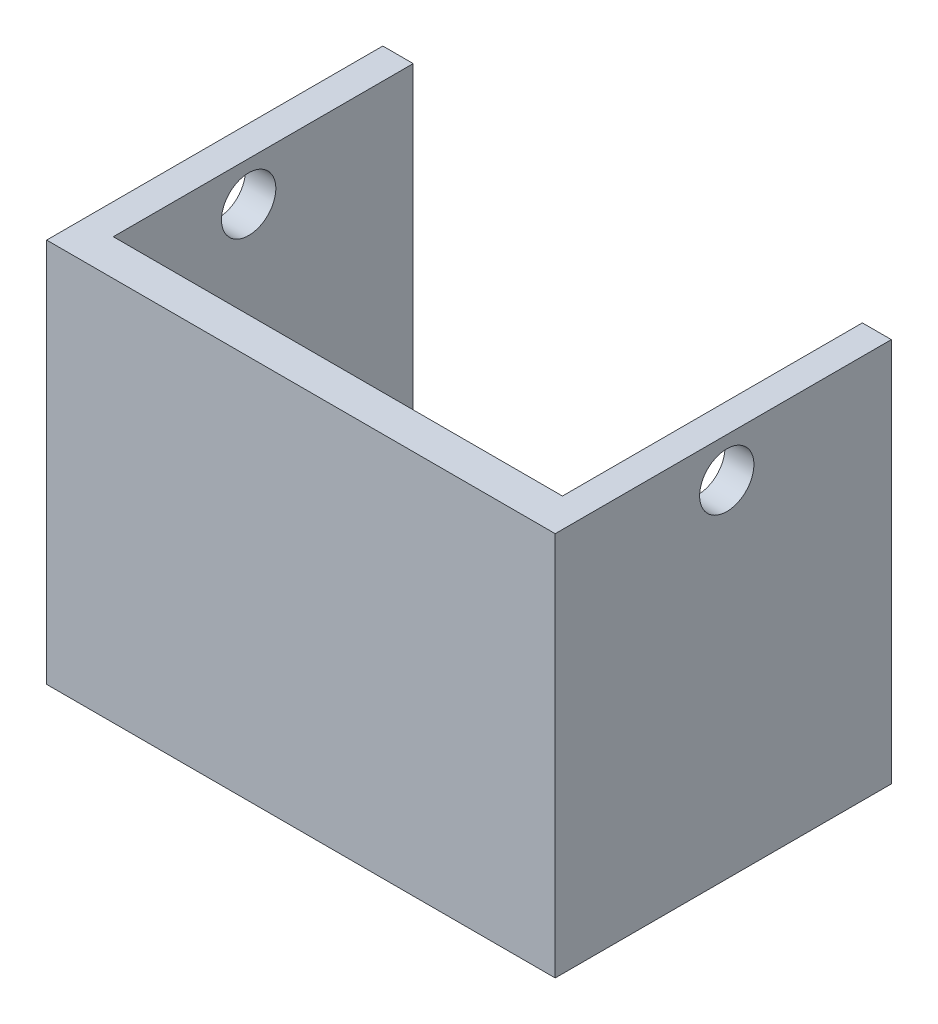
ISO-10303-21;
HEADER;
FILE_DESCRIPTION(('STEP AP214'),'2;1');
FILE_NAME('part.step','',(''),(''),'','','');
FILE_SCHEMA(('AUTOMOTIVE_DESIGN { 1 0 10303 214 1 1 1 1 }'));
ENDSEC;
DATA;
#1=APPLICATION_CONTEXT('core data for automotive mechanical design processes');
#2=APPLICATION_PROTOCOL_DEFINITION('international standard','automotive_design',2000,#1);
#3=PRODUCT_CONTEXT('',#1,'mechanical');
#4=PRODUCT('Part','Part','',(#3));
#5=PRODUCT_RELATED_PRODUCT_CATEGORY('part','',(#4));
#6=PRODUCT_DEFINITION_FORMATION('','',#4);
#7=PRODUCT_DEFINITION_CONTEXT('part definition',#1,'design');
#8=PRODUCT_DEFINITION('design','',#6,#7);
#9=PRODUCT_DEFINITION_SHAPE('','',#8);
#10=(LENGTH_UNIT() NAMED_UNIT(*) SI_UNIT(.MILLI.,.METRE.));
#11=(NAMED_UNIT(*) PLANE_ANGLE_UNIT() SI_UNIT($,.RADIAN.));
#12=(NAMED_UNIT(*) SI_UNIT($,.STERADIAN.) SOLID_ANGLE_UNIT());
#13=UNCERTAINTY_MEASURE_WITH_UNIT(LENGTH_MEASURE(1.E-05),#10,'distance_accuracy_value','');
#14=(GEOMETRIC_REPRESENTATION_CONTEXT(3) GLOBAL_UNCERTAINTY_ASSIGNED_CONTEXT((#13)) GLOBAL_UNIT_ASSIGNED_CONTEXT((#10,
#11,#12)) REPRESENTATION_CONTEXT('',''));
#15=CARTESIAN_POINT('',(0.,0.,0.));
#16=DIRECTION('',(0.,0.,1.));
#17=DIRECTION('',(1.,0.,0.));
#18=AXIS2_PLACEMENT_3D('',#15,#16,#17);
#19=CARTESIAN_POINT('',(45.9061351621765,60.,12.9867525434729));
#20=DIRECTION('',(0.,0.,-1.));
#21=DIRECTION('',(-1.,0.,0.));
#22=AXIS2_PLACEMENT_3D('',#19,#20,#21);
#23=PLANE('',#22);
#24=DIRECTION('',(1.,0.,0.));
#25=VECTOR('',#24,1.);
#26=CARTESIAN_POINT('',(45.9061351621765,0.,12.9867525434729));
#27=LINE('',#26,#25);
#28=CARTESIAN_POINT('',(-33.3883853900331,0.,12.9867525434729));
#29=VERTEX_POINT('',#28);
#30=CARTESIAN_POINT('',(45.9061351621765,0.,12.9867525434729));
#31=VERTEX_POINT('',#30);
#32=EDGE_CURVE('E144',#29,#31,#27,.T.);
#33=ORIENTED_EDGE('',*,*,#32,.T.);
#34=DIRECTION('',(0.,-1.,0.));
#35=VECTOR('',#34,1.);
#36=CARTESIAN_POINT('',(45.9061351621765,60.,12.9867525434729));
#37=LINE('',#36,#35);
#38=CARTESIAN_POINT('',(45.9061351621765,60.,12.9867525434729));
#39=VERTEX_POINT('',#38);
#40=EDGE_CURVE('E48',#39,#31,#37,.T.);
#41=ORIENTED_EDGE('',*,*,#40,.F.);
#42=DIRECTION('',(1.,0.,0.));
#43=VECTOR('',#42,1.);
#44=CARTESIAN_POINT('',(45.9061351621765,60.,12.9867525434729));
#45=LINE('',#44,#43);
#46=CARTESIAN_POINT('',(-33.3883853900331,60.,12.9867525434729));
#47=VERTEX_POINT('',#46);
#48=EDGE_CURVE('E99',#47,#39,#45,.T.);
#49=ORIENTED_EDGE('',*,*,#48,.F.);
#50=DIRECTION('',(0.,-1.,0.));
#51=VECTOR('',#50,1.);
#52=CARTESIAN_POINT('',(-33.3883853900331,60.,12.9867525434729));
#53=LINE('',#52,#51);
#54=EDGE_CURVE('E11',#47,#29,#53,.T.);
#55=ORIENTED_EDGE('',*,*,#54,.T.);
#56=EDGE_LOOP('',(#33,#41,#49,#55));
#57=FACE_BOUND('',#56,.T.);
#58=ADVANCED_FACE('F39',(#57),#23,.F.);
#59=CARTESIAN_POINT('',(45.9061351621765,60.,-39.4244405280731));
#60=DIRECTION('',(-1.,0.,0.));
#61=DIRECTION('',(0.,0.,1.));
#62=AXIS2_PLACEMENT_3D('',#59,#60,#61);
#63=PLANE('',#62);
#64=CARTESIAN_POINT('',(45.9061351621765,53.8443619480375,-13.7638526042991));
#65=DIRECTION('',(-1.,0.,0.));
#66=DIRECTION('',(0.,0.,1.));
#67=AXIS2_PLACEMENT_3D('',#64,#65,#66);
#68=CIRCLE('',#67,4.23503961029031);
#69=CARTESIAN_POINT('',(45.9061351621765,53.8443619480375,-9.52881299400882));
#70=VERTEX_POINT('',#69);
#71=EDGE_CURVE('E148',#70,#70,#68,.T.);
#72=ORIENTED_EDGE('',*,*,#71,.T.);
#73=EDGE_LOOP('',(#72));
#74=FACE_BOUND('',#73,.T.);
#75=DIRECTION('',(0.,0.,-1.));
#76=VECTOR('',#75,1.);
#77=CARTESIAN_POINT('',(45.9061351621765,0.,-39.4244405280731));
#78=LINE('',#77,#76);
#79=CARTESIAN_POINT('',(45.9061351621765,0.,-39.4244405280731));
#80=VERTEX_POINT('',#79);
#81=EDGE_CURVE('E147',#31,#80,#78,.T.);
#82=ORIENTED_EDGE('',*,*,#81,.T.);
#83=DIRECTION('',(0.,-1.,0.));
#84=VECTOR('',#83,1.);
#85=CARTESIAN_POINT('',(45.9061351621765,60.,-39.4244405280731));
#86=LINE('',#85,#84);
#87=CARTESIAN_POINT('',(45.9061351621765,60.,-39.4244405280731));
#88=VERTEX_POINT('',#87);
#89=EDGE_CURVE('E176',#88,#80,#86,.T.);
#90=ORIENTED_EDGE('',*,*,#89,.F.);
#91=DIRECTION('',(0.,0.,-1.));
#92=VECTOR('',#91,1.);
#93=CARTESIAN_POINT('',(45.9061351621765,60.,-39.4244405280731));
#94=LINE('',#93,#92);
#95=EDGE_CURVE('E186',#39,#88,#94,.T.);
#96=ORIENTED_EDGE('',*,*,#95,.F.);
#97=ORIENTED_EDGE('',*,*,#40,.T.);
#98=EDGE_LOOP('',(#82,#90,#96,#97));
#99=FACE_BOUND('',#98,.T.);
#100=ADVANCED_FACE('F184',(#74,#99),#63,.F.);
#101=CARTESIAN_POINT('',(41.3879288629053,60.,-39.4244405280731));
#102=DIRECTION('',(0.,0.,1.));
#103=DIRECTION('',(1.,0.,0.));
#104=AXIS2_PLACEMENT_3D('',#101,#102,#103);
#105=PLANE('',#104);
#106=DIRECTION('',(-1.,0.,0.));
#107=VECTOR('',#106,1.);
#108=CARTESIAN_POINT('',(41.3879288629053,0.,-39.4244405280731));
#109=LINE('',#108,#107);
#110=CARTESIAN_POINT('',(41.3879288629053,0.,-39.4244405280731));
#111=VERTEX_POINT('',#110);
#112=EDGE_CURVE('E151',#80,#111,#109,.T.);
#113=ORIENTED_EDGE('',*,*,#112,.T.);
#114=DIRECTION('',(0.,-1.,0.));
#115=VECTOR('',#114,1.);
#116=CARTESIAN_POINT('',(41.3879288629053,60.,-39.4244405280731));
#117=LINE('',#116,#115);
#118=CARTESIAN_POINT('',(41.3879288629053,60.,-39.4244405280731));
#119=VERTEX_POINT('',#118);
#120=EDGE_CURVE('E172',#119,#111,#117,.T.);
#121=ORIENTED_EDGE('',*,*,#120,.F.);
#122=DIRECTION('',(-1.,0.,0.));
#123=VECTOR('',#122,1.);
#124=CARTESIAN_POINT('',(41.3879288629053,60.,-39.4244405280731));
#125=LINE('',#124,#123);
#126=EDGE_CURVE('E200',#88,#119,#125,.T.);
#127=ORIENTED_EDGE('',*,*,#126,.F.);
#128=ORIENTED_EDGE('',*,*,#89,.T.);
#129=EDGE_LOOP('',(#113,#121,#127,#128));
#130=FACE_BOUND('',#129,.T.);
#131=ADVANCED_FACE('F195',(#130),#105,.F.);
#132=CARTESIAN_POINT('',(41.3879288629053,60.,7.33899466938386));
#133=DIRECTION('',(1.,0.,0.));
#134=DIRECTION('',(0.,0.,-1.));
#135=AXIS2_PLACEMENT_3D('',#132,#133,#134);
#136=PLANE('',#135);
#137=CARTESIAN_POINT('',(41.3879288629053,53.8443619480375,-13.7638526042991));
#138=DIRECTION('',(1.,0.,0.));
#139=DIRECTION('',(0.,0.,-1.));
#140=AXIS2_PLACEMENT_3D('',#137,#138,#139);
#141=CIRCLE('',#140,4.23503961029031);
#142=CARTESIAN_POINT('',(41.3879288629053,53.8443619480375,-17.9988922145894));
#143=VERTEX_POINT('',#142);
#144=EDGE_CURVE('E213',#143,#143,#141,.T.);
#145=ORIENTED_EDGE('',*,*,#144,.T.);
#146=EDGE_LOOP('',(#145));
#147=FACE_BOUND('',#146,.T.);
#148=DIRECTION('',(0.,0.,1.));
#149=VECTOR('',#148,1.);
#150=CARTESIAN_POINT('',(41.3879288629053,0.,7.33899466938386));
#151=LINE('',#150,#149);
#152=CARTESIAN_POINT('',(41.3879288629053,0.,7.33899466938386));
#153=VERTEX_POINT('',#152);
#154=EDGE_CURVE('E154',#111,#153,#151,.T.);
#155=ORIENTED_EDGE('',*,*,#154,.T.);
#156=DIRECTION('',(0.,-1.,0.));
#157=VECTOR('',#156,1.);
#158=CARTESIAN_POINT('',(41.3879288629053,60.,7.33899466938386));
#159=LINE('',#158,#157);
#160=CARTESIAN_POINT('',(41.3879288629053,60.,7.33899466938386));
#161=VERTEX_POINT('',#160);
#162=EDGE_CURVE('E131',#161,#153,#159,.T.);
#163=ORIENTED_EDGE('',*,*,#162,.F.);
#164=DIRECTION('',(0.,0.,1.));
#165=VECTOR('',#164,1.);
#166=CARTESIAN_POINT('',(41.3879288629053,60.,7.33899466938386));
#167=LINE('',#166,#165);
#168=EDGE_CURVE('E119',#119,#161,#167,.T.);
#169=ORIENTED_EDGE('',*,*,#168,.F.);
#170=ORIENTED_EDGE('',*,*,#120,.T.);
#171=EDGE_LOOP('',(#155,#163,#169,#170));
#172=FACE_BOUND('',#171,.T.);
#173=ADVANCED_FACE('F198',(#147,#172),#136,.F.);
#174=CARTESIAN_POINT('',(-28.6442687757983,60.,7.33899466938386));
#175=DIRECTION('',(0.,0.,1.));
#176=DIRECTION('',(1.,0.,0.));
#177=AXIS2_PLACEMENT_3D('',#174,#175,#176);
#178=PLANE('',#177);
#179=DIRECTION('',(-1.,0.,0.));
#180=VECTOR('',#179,1.);
#181=CARTESIAN_POINT('',(-28.6442687757983,0.,7.33899466938386));
#182=LINE('',#181,#180);
#183=CARTESIAN_POINT('',(-28.6442687757983,0.,7.33899466938386));
#184=VERTEX_POINT('',#183);
#185=EDGE_CURVE('E129',#153,#184,#182,.T.);
#186=ORIENTED_EDGE('',*,*,#185,.T.);
#187=DIRECTION('',(0.,-1.,0.));
#188=VECTOR('',#187,1.);
#189=CARTESIAN_POINT('',(-28.6442687757983,60.,7.33899466938386));
#190=LINE('',#189,#188);
#191=CARTESIAN_POINT('',(-28.6442687757983,60.,7.33899466938386));
#192=VERTEX_POINT('',#191);
#193=EDGE_CURVE('E126',#192,#184,#190,.T.);
#194=ORIENTED_EDGE('',*,*,#193,.F.);
#195=DIRECTION('',(-1.,0.,0.));
#196=VECTOR('',#195,1.);
#197=CARTESIAN_POINT('',(-28.6442687757983,60.,7.33899466938386));
#198=LINE('',#197,#196);
#199=EDGE_CURVE('E113',#161,#192,#198,.T.);
#200=ORIENTED_EDGE('',*,*,#199,.F.);
#201=ORIENTED_EDGE('',*,*,#162,.T.);
#202=EDGE_LOOP('',(#186,#194,#200,#201));
#203=FACE_BOUND('',#202,.T.);
#204=ADVANCED_FACE('F127',(#203),#178,.F.);
#205=CARTESIAN_POINT('',(-28.6442687757983,60.,-39.4244405280731));
#206=DIRECTION('',(-1.,0.,0.));
#207=DIRECTION('',(0.,0.,1.));
#208=AXIS2_PLACEMENT_3D('',#205,#206,#207);
#209=PLANE('',#208);
#210=CARTESIAN_POINT('',(-28.6442687757983,53.8443619480375,-13.7638526042991));
#211=DIRECTION('',(-1.,0.,0.));
#212=DIRECTION('',(0.,0.,1.));
#213=AXIS2_PLACEMENT_3D('',#210,#211,#212);
#214=CIRCLE('',#213,4.23503961029031);
#215=CARTESIAN_POINT('',(-28.6442687757983,53.8443619480375,-9.52881299400882));
#216=VERTEX_POINT('',#215);
#217=EDGE_CURVE('E217',#216,#216,#214,.T.);
#218=ORIENTED_EDGE('',*,*,#217,.T.);
#219=EDGE_LOOP('',(#218));
#220=FACE_BOUND('',#219,.T.);
#221=DIRECTION('',(0.,0.,-1.));
#222=VECTOR('',#221,1.);
#223=CARTESIAN_POINT('',(-28.6442687757983,0.,-39.4244405280731));
#224=LINE('',#223,#222);
#225=CARTESIAN_POINT('',(-28.6442687757983,0.,-39.4244405280731));
#226=VERTEX_POINT('',#225);
#227=EDGE_CURVE('E85',#184,#226,#224,.T.);
#228=ORIENTED_EDGE('',*,*,#227,.T.);
#229=DIRECTION('',(0.,-1.,0.));
#230=VECTOR('',#229,1.);
#231=CARTESIAN_POINT('',(-28.6442687757983,60.,-39.4244405280731));
#232=LINE('',#231,#230);
#233=CARTESIAN_POINT('',(-28.6442687757983,60.,-39.4244405280731));
#234=VERTEX_POINT('',#233);
#235=EDGE_CURVE('E132',#234,#226,#232,.T.);
#236=ORIENTED_EDGE('',*,*,#235,.F.);
#237=DIRECTION('',(0.,0.,-1.));
#238=VECTOR('',#237,1.);
#239=CARTESIAN_POINT('',(-28.6442687757983,60.,0.));
#240=LINE('',#239,#238);
#241=EDGE_CURVE('E117',#192,#234,#240,.T.);
#242=ORIENTED_EDGE('',*,*,#241,.F.);
#243=ORIENTED_EDGE('',*,*,#193,.T.);
#244=EDGE_LOOP('',(#228,#236,#242,#243));
#245=FACE_BOUND('',#244,.T.);
#246=ADVANCED_FACE('F134',(#220,#245),#209,.F.);
#247=CARTESIAN_POINT('',(-33.3883853900331,60.,-39.4244405280731));
#248=DIRECTION('',(0.,0.,1.));
#249=DIRECTION('',(1.,0.,0.));
#250=AXIS2_PLACEMENT_3D('',#247,#248,#249);
#251=PLANE('',#250);
#252=DIRECTION('',(-1.,0.,0.));
#253=VECTOR('',#252,1.);
#254=CARTESIAN_POINT('',(-33.3883853900331,0.,-39.4244405280731));
#255=LINE('',#254,#253);
#256=CARTESIAN_POINT('',(-33.3883853900331,0.,-39.4244405280731));
#257=VERTEX_POINT('',#256);
#258=EDGE_CURVE('E92',#226,#257,#255,.T.);
#259=ORIENTED_EDGE('',*,*,#258,.T.);
#260=DIRECTION('',(0.,-1.,0.));
#261=VECTOR('',#260,1.);
#262=CARTESIAN_POINT('',(-33.3883853900331,60.,-39.4244405280731));
#263=LINE('',#262,#261);
#264=CARTESIAN_POINT('',(-33.3883853900331,60.,-39.4244405280731));
#265=VERTEX_POINT('',#264);
#266=EDGE_CURVE('E140',#265,#257,#263,.T.);
#267=ORIENTED_EDGE('',*,*,#266,.F.);
#268=DIRECTION('',(-1.,0.,0.));
#269=VECTOR('',#268,1.);
#270=CARTESIAN_POINT('',(-33.3883853900331,60.,-39.4244405280731));
#271=LINE('',#270,#269);
#272=EDGE_CURVE('E137',#234,#265,#271,.T.);
#273=ORIENTED_EDGE('',*,*,#272,.F.);
#274=ORIENTED_EDGE('',*,*,#235,.T.);
#275=EDGE_LOOP('',(#259,#267,#273,#274));
#276=FACE_BOUND('',#275,.T.);
#277=ADVANCED_FACE('F231',(#276),#251,.F.);
#278=CARTESIAN_POINT('',(-33.3883853900331,60.,0.));
#279=DIRECTION('',(1.,0.,0.));
#280=DIRECTION('',(0.,0.,-1.));
#281=AXIS2_PLACEMENT_3D('',#278,#279,#280);
#282=PLANE('',#281);
#283=CARTESIAN_POINT('',(-33.3883853900331,53.8443619480375,-13.7638526042991));
#284=DIRECTION('',(-1.,0.,0.));
#285=DIRECTION('',(0.,0.,1.));
#286=AXIS2_PLACEMENT_3D('',#283,#284,#285);
#287=CIRCLE('',#286,4.23503961029031);
#288=CARTESIAN_POINT('',(-33.3883853900331,53.8443619480375,-9.52881299400882));
#289=VERTEX_POINT('',#288);
#290=EDGE_CURVE('E221',#289,#289,#287,.T.);
#291=ORIENTED_EDGE('',*,*,#290,.F.);
#292=EDGE_LOOP('',(#291));
#293=FACE_BOUND('',#292,.T.);
#294=DIRECTION('',(0.,0.,1.));
#295=VECTOR('',#294,1.);
#296=CARTESIAN_POINT('',(-33.3883853900331,0.,0.));
#297=LINE('',#296,#295);
#298=EDGE_CURVE('E163',#257,#29,#297,.T.);
#299=ORIENTED_EDGE('',*,*,#298,.T.);
#300=ORIENTED_EDGE('',*,*,#54,.F.);
#301=DIRECTION('',(0.,0.,1.));
#302=VECTOR('',#301,1.);
#303=CARTESIAN_POINT('',(-33.3883853900331,60.,12.9867525434729));
#304=LINE('',#303,#302);
#305=EDGE_CURVE('E56',#265,#47,#304,.T.);
#306=ORIENTED_EDGE('',*,*,#305,.F.);
#307=ORIENTED_EDGE('',*,*,#266,.T.);
#308=EDGE_LOOP('',(#299,#300,#306,#307));
#309=FACE_BOUND('',#308,.T.);
#310=ADVANCED_FACE('F229',(#293,#309),#282,.F.);
#311=CARTESIAN_POINT('',(0.,60.,0.));
#312=DIRECTION('',(0.,-1.,0.));
#313=DIRECTION('',(0.,0.,-1.));
#314=AXIS2_PLACEMENT_3D('',#311,#312,#313);
#315=PLANE('',#314);
#316=ORIENTED_EDGE('',*,*,#305,.T.);
#317=ORIENTED_EDGE('',*,*,#48,.T.);
#318=ORIENTED_EDGE('',*,*,#95,.T.);
#319=ORIENTED_EDGE('',*,*,#126,.T.);
#320=ORIENTED_EDGE('',*,*,#168,.T.);
#321=ORIENTED_EDGE('',*,*,#199,.T.);
#322=ORIENTED_EDGE('',*,*,#241,.T.);
#323=ORIENTED_EDGE('',*,*,#272,.T.);
#324=EDGE_LOOP('',(#316,#317,#318,#319,#320,#321,#322,#323));
#325=FACE_BOUND('',#324,.T.);
#326=ADVANCED_FACE('F115',(#325),#315,.F.);
#327=CARTESIAN_POINT('',(0.,0.,0.));
#328=DIRECTION('',(0.,-1.,0.));
#329=DIRECTION('',(0.,0.,-1.));
#330=AXIS2_PLACEMENT_3D('',#327,#328,#329);
#331=PLANE('',#330);
#332=ORIENTED_EDGE('',*,*,#32,.F.);
#333=ORIENTED_EDGE('',*,*,#298,.F.);
#334=ORIENTED_EDGE('',*,*,#258,.F.);
#335=ORIENTED_EDGE('',*,*,#227,.F.);
#336=ORIENTED_EDGE('',*,*,#185,.F.);
#337=ORIENTED_EDGE('',*,*,#154,.F.);
#338=ORIENTED_EDGE('',*,*,#112,.F.);
#339=ORIENTED_EDGE('',*,*,#81,.F.);
#340=EDGE_LOOP('',(#332,#333,#334,#335,#336,#337,#338,#339));
#341=FACE_BOUND('',#340,.T.);
#342=ADVANCED_FACE('F190',(#341),#331,.T.);
#343=CARTESIAN_POINT('',(76.6116146099669,53.8443619480375,-13.7638526042991));
#344=DIRECTION('',(-1.,0.,0.));
#345=DIRECTION('',(0.,0.,1.));
#346=AXIS2_PLACEMENT_3D('',#343,#344,#345);
#347=CYLINDRICAL_SURFACE('',#346,4.23503961029031);
#348=ORIENTED_EDGE('',*,*,#290,.T.);
#349=EDGE_LOOP('',(#348));
#350=FACE_BOUND('',#349,.T.);
#351=ORIENTED_EDGE('',*,*,#217,.F.);
#352=EDGE_LOOP('',(#351));
#353=FACE_BOUND('',#352,.T.);
#354=ADVANCED_FACE('F226',(#350,#353),#347,.F.);
#355=ORIENTED_EDGE('',*,*,#144,.F.);
#356=EDGE_LOOP('',(#355));
#357=FACE_BOUND('',#356,.T.);
#358=ORIENTED_EDGE('',*,*,#71,.F.);
#359=EDGE_LOOP('',(#358));
#360=FACE_BOUND('',#359,.T.);
#361=ADVANCED_FACE('F285',(#357,#360),#347,.F.);
#362=CLOSED_SHELL('',(#58,#100,#131,#173,#204,#246,#277,#310,#326,#342,#354,#361));
#363=MANIFOLD_SOLID_BREP('B2',#362);
#364=ADVANCED_BREP_SHAPE_REPRESENTATION('',(#18,#363),#14);
#365=SHAPE_DEFINITION_REPRESENTATION(#9,#364);
ENDSEC;
END-ISO-10303-21;
